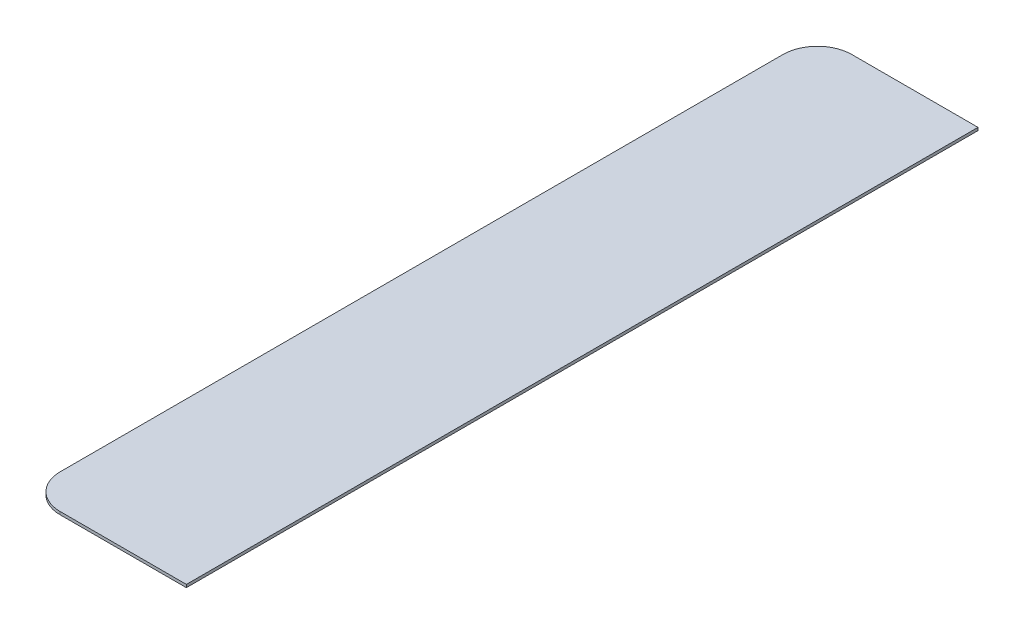
ISO-10303-21;
HEADER;
FILE_DESCRIPTION(('STEP AP214'),'2;1');
FILE_NAME('part.step','',(''),(''),'','','');
FILE_SCHEMA(('AUTOMOTIVE_DESIGN { 1 0 10303 214 1 1 1 1 }'));
ENDSEC;
DATA;
#1=APPLICATION_CONTEXT('core data for automotive mechanical design processes');
#2=APPLICATION_PROTOCOL_DEFINITION('international standard','automotive_design',2000,#1);
#3=PRODUCT_CONTEXT('',#1,'mechanical');
#4=PRODUCT('Part','Part','',(#3));
#5=PRODUCT_RELATED_PRODUCT_CATEGORY('part','',(#4));
#6=PRODUCT_DEFINITION_FORMATION('','',#4);
#7=PRODUCT_DEFINITION_CONTEXT('part definition',#1,'design');
#8=PRODUCT_DEFINITION('design','',#6,#7);
#9=PRODUCT_DEFINITION_SHAPE('','',#8);
#10=(LENGTH_UNIT() NAMED_UNIT(*) SI_UNIT(.MILLI.,.METRE.));
#11=(NAMED_UNIT(*) PLANE_ANGLE_UNIT() SI_UNIT($,.RADIAN.));
#12=(NAMED_UNIT(*) SI_UNIT($,.STERADIAN.) SOLID_ANGLE_UNIT());
#13=UNCERTAINTY_MEASURE_WITH_UNIT(LENGTH_MEASURE(1.E-05),#10,'distance_accuracy_value','');
#14=(GEOMETRIC_REPRESENTATION_CONTEXT(3) GLOBAL_UNCERTAINTY_ASSIGNED_CONTEXT((#13)) GLOBAL_UNIT_ASSIGNED_CONTEXT((#10,
#11,#12)) REPRESENTATION_CONTEXT('',''));
#15=CARTESIAN_POINT('',(0.,0.,0.));
#16=DIRECTION('',(0.,0.,1.));
#17=DIRECTION('',(1.,0.,0.));
#18=AXIS2_PLACEMENT_3D('',#15,#16,#17);
#19=CARTESIAN_POINT('',(0.,6.35,0.));
#20=DIRECTION('',(-1.,0.,0.));
#21=DIRECTION('',(0.,0.,1.));
#22=AXIS2_PLACEMENT_3D('',#19,#20,#21);
#23=PLANE('',#22);
#24=DIRECTION('',(0.,0.,-1.));
#25=VECTOR('',#24,1.);
#26=CARTESIAN_POINT('',(0.,0.,0.));
#27=LINE('',#26,#25);
#28=CARTESIAN_POINT('',(2.14631598018565E-13,0.,1752.6));
#29=VERTEX_POINT('',#28);
#30=CARTESIAN_POINT('',(0.,0.,0.));
#31=VERTEX_POINT('',#30);
#32=EDGE_CURVE('E121',#29,#31,#27,.T.);
#33=ORIENTED_EDGE('',*,*,#32,.T.);
#34=DIRECTION('',(0.,-1.,0.));
#35=VECTOR('',#34,1.);
#36=CARTESIAN_POINT('',(0.,6.35,0.));
#37=LINE('',#36,#35);
#38=CARTESIAN_POINT('',(0.,6.35,0.));
#39=VERTEX_POINT('',#38);
#40=EDGE_CURVE('E11',#39,#31,#37,.T.);
#41=ORIENTED_EDGE('',*,*,#40,.F.);
#42=DIRECTION('',(0.,0.,-1.));
#43=VECTOR('',#42,1.);
#44=CARTESIAN_POINT('',(0.,6.35,0.));
#45=LINE('',#44,#43);
#46=CARTESIAN_POINT('',(2.14631598018565E-13,6.35,1752.6));
#47=VERTEX_POINT('',#46);
#48=EDGE_CURVE('E131',#47,#39,#45,.T.);
#49=ORIENTED_EDGE('',*,*,#48,.F.);
#50=DIRECTION('',(0.,-1.,0.));
#51=VECTOR('',#50,1.);
#52=CARTESIAN_POINT('',(2.14631598018565E-13,6.35,1752.6));
#53=LINE('',#52,#51);
#54=EDGE_CURVE('E117',#47,#29,#53,.T.);
#55=ORIENTED_EDGE('',*,*,#54,.T.);
#56=EDGE_LOOP('',(#33,#41,#49,#55));
#57=FACE_BOUND('',#56,.T.);
#58=ADVANCED_FACE('F37',(#57),#23,.F.);
#59=CARTESIAN_POINT('',(0.,6.35,0.));
#60=DIRECTION('',(0.,0.,1.));
#61=DIRECTION('',(1.,0.,0.));
#62=AXIS2_PLACEMENT_3D('',#59,#60,#61);
#63=PLANE('',#62);
#64=DIRECTION('',(-1.,0.,0.));
#65=VECTOR('',#64,1.);
#66=CARTESIAN_POINT('',(0.,0.,0.));
#67=LINE('',#66,#65);
#68=CARTESIAN_POINT('',(-279.399999999999,0.,0.));
#69=VERTEX_POINT('',#68);
#70=EDGE_CURVE('E124',#31,#69,#67,.T.);
#71=ORIENTED_EDGE('',*,*,#70,.T.);
#72=DIRECTION('',(0.,-1.,0.));
#73=VECTOR('',#72,1.);
#74=CARTESIAN_POINT('',(-279.399999999999,6.35,0.));
#75=LINE('',#74,#73);
#76=CARTESIAN_POINT('',(-279.399999999999,6.35,0.));
#77=VERTEX_POINT('',#76);
#78=EDGE_CURVE('E45',#77,#69,#75,.T.);
#79=ORIENTED_EDGE('',*,*,#78,.F.);
#80=DIRECTION('',(-1.,0.,0.));
#81=VECTOR('',#80,1.);
#82=CARTESIAN_POINT('',(0.,6.35,0.));
#83=LINE('',#82,#81);
#84=EDGE_CURVE('E90',#39,#77,#83,.T.);
#85=ORIENTED_EDGE('',*,*,#84,.F.);
#86=ORIENTED_EDGE('',*,*,#40,.T.);
#87=EDGE_LOOP('',(#71,#79,#85,#86));
#88=FACE_BOUND('',#87,.T.);
#89=ADVANCED_FACE('F155',(#88),#63,.F.);
#90=CARTESIAN_POINT('',(-279.4,6.35,76.2));
#91=DIRECTION('',(0.,-1.,0.));
#92=DIRECTION('',(0.,0.,-1.));
#93=AXIS2_PLACEMENT_3D('',#90,#91,#92);
#94=CYLINDRICAL_SURFACE('',#93,76.2);
#95=CARTESIAN_POINT('',(-279.4,0.,76.2));
#96=DIRECTION('',(0.,1.,0.));
#97=DIRECTION('',(0.,0.,-1.));
#98=AXIS2_PLACEMENT_3D('',#95,#96,#97);
#99=CIRCLE('',#98,76.2);
#100=CARTESIAN_POINT('',(-355.6,0.,76.2000000000006));
#101=VERTEX_POINT('',#100);
#102=EDGE_CURVE('E126',#69,#101,#99,.T.);
#103=ORIENTED_EDGE('',*,*,#102,.T.);
#104=DIRECTION('',(0.,-1.,0.));
#105=VECTOR('',#104,1.);
#106=CARTESIAN_POINT('',(-355.6,6.35,76.2000000000006));
#107=LINE('',#106,#105);
#108=CARTESIAN_POINT('',(-355.6,6.35,76.2000000000006));
#109=VERTEX_POINT('',#108);
#110=EDGE_CURVE('E112',#109,#101,#107,.T.);
#111=ORIENTED_EDGE('',*,*,#110,.F.);
#112=CARTESIAN_POINT('',(-279.4,6.35,76.2));
#113=DIRECTION('',(0.,1.,0.));
#114=DIRECTION('',(0.,0.,-1.));
#115=AXIS2_PLACEMENT_3D('',#112,#113,#114);
#116=CIRCLE('',#115,76.2);
#117=EDGE_CURVE('E103',#77,#109,#116,.T.);
#118=ORIENTED_EDGE('',*,*,#117,.F.);
#119=ORIENTED_EDGE('',*,*,#78,.T.);
#120=EDGE_LOOP('',(#103,#111,#118,#119));
#121=FACE_BOUND('',#120,.T.);
#122=ADVANCED_FACE('F137',(#121),#94,.T.);
#123=CARTESIAN_POINT('',(-355.6,6.35,76.2000000000006));
#124=DIRECTION('',(1.,0.,0.));
#125=DIRECTION('',(0.,0.,-1.));
#126=AXIS2_PLACEMENT_3D('',#123,#124,#125);
#127=PLANE('',#126);
#128=DIRECTION('',(0.,0.,1.));
#129=VECTOR('',#128,1.);
#130=CARTESIAN_POINT('',(-355.6,0.,76.2000000000006));
#131=LINE('',#130,#129);
#132=CARTESIAN_POINT('',(-355.6,0.,1676.4));
#133=VERTEX_POINT('',#132);
#134=EDGE_CURVE('E111',#101,#133,#131,.T.);
#135=ORIENTED_EDGE('',*,*,#134,.T.);
#136=DIRECTION('',(0.,-1.,0.));
#137=VECTOR('',#136,1.);
#138=CARTESIAN_POINT('',(-355.6,6.35,1676.4));
#139=LINE('',#138,#137);
#140=CARTESIAN_POINT('',(-355.6,6.35,1676.4));
#141=VERTEX_POINT('',#140);
#142=EDGE_CURVE('E108',#141,#133,#139,.T.);
#143=ORIENTED_EDGE('',*,*,#142,.F.);
#144=DIRECTION('',(0.,0.,1.));
#145=VECTOR('',#144,1.);
#146=CARTESIAN_POINT('',(-355.6,6.35,76.2000000000006));
#147=LINE('',#146,#145);
#148=EDGE_CURVE('E97',#109,#141,#147,.T.);
#149=ORIENTED_EDGE('',*,*,#148,.F.);
#150=ORIENTED_EDGE('',*,*,#110,.T.);
#151=EDGE_LOOP('',(#135,#143,#149,#150));
#152=FACE_BOUND('',#151,.T.);
#153=ADVANCED_FACE('F109',(#152),#127,.F.);
#154=CARTESIAN_POINT('',(-279.4,6.35,1676.4));
#155=DIRECTION('',(0.,-1.,0.));
#156=DIRECTION('',(0.,0.,-1.));
#157=AXIS2_PLACEMENT_3D('',#154,#155,#156);
#158=CYLINDRICAL_SURFACE('',#157,76.2);
#159=CARTESIAN_POINT('',(-279.4,0.,1676.4));
#160=DIRECTION('',(0.,1.,0.));
#161=DIRECTION('',(0.,0.,1.));
#162=AXIS2_PLACEMENT_3D('',#159,#160,#161);
#163=CIRCLE('',#162,76.2);
#164=CARTESIAN_POINT('',(-279.4,0.,1752.6));
#165=VERTEX_POINT('',#164);
#166=EDGE_CURVE('E76',#133,#165,#163,.T.);
#167=ORIENTED_EDGE('',*,*,#166,.T.);
#168=DIRECTION('',(0.,-1.,0.));
#169=VECTOR('',#168,1.);
#170=CARTESIAN_POINT('',(-279.4,6.35,1752.6));
#171=LINE('',#170,#169);
#172=CARTESIAN_POINT('',(-279.4,6.35,1752.6));
#173=VERTEX_POINT('',#172);
#174=EDGE_CURVE('E113',#173,#165,#171,.T.);
#175=ORIENTED_EDGE('',*,*,#174,.F.);
#176=CARTESIAN_POINT('',(-279.4,6.35,1676.4));
#177=DIRECTION('',(0.,1.,0.));
#178=DIRECTION('',(0.,0.,1.));
#179=AXIS2_PLACEMENT_3D('',#176,#177,#178);
#180=CIRCLE('',#179,76.2);
#181=EDGE_CURVE('E101',#141,#173,#180,.T.);
#182=ORIENTED_EDGE('',*,*,#181,.F.);
#183=ORIENTED_EDGE('',*,*,#142,.T.);
#184=EDGE_LOOP('',(#167,#175,#182,#183));
#185=FACE_BOUND('',#184,.T.);
#186=ADVANCED_FACE('F115',(#185),#158,.T.);
#187=CARTESIAN_POINT('',(2.14631598018565E-13,6.35,1752.6));
#188=DIRECTION('',(0.,0.,-1.));
#189=DIRECTION('',(-1.,0.,0.));
#190=AXIS2_PLACEMENT_3D('',#187,#188,#189);
#191=PLANE('',#190);
#192=DIRECTION('',(1.,0.,0.));
#193=VECTOR('',#192,1.);
#194=CARTESIAN_POINT('',(2.14631598018565E-13,0.,1752.6));
#195=LINE('',#194,#193);
#196=EDGE_CURVE('E82',#165,#29,#195,.T.);
#197=ORIENTED_EDGE('',*,*,#196,.T.);
#198=ORIENTED_EDGE('',*,*,#54,.F.);
#199=DIRECTION('',(1.,0.,0.));
#200=VECTOR('',#199,1.);
#201=CARTESIAN_POINT('',(2.14631598018565E-13,6.35,1752.6));
#202=LINE('',#201,#200);
#203=EDGE_CURVE('E53',#173,#47,#202,.T.);
#204=ORIENTED_EDGE('',*,*,#203,.F.);
#205=ORIENTED_EDGE('',*,*,#174,.T.);
#206=EDGE_LOOP('',(#197,#198,#204,#205));
#207=FACE_BOUND('',#206,.T.);
#208=ADVANCED_FACE('F144',(#207),#191,.F.);
#209=CARTESIAN_POINT('',(-279.4,6.35,1676.4));
#210=DIRECTION('',(0.,1.,0.));
#211=DIRECTION('',(0.,0.,1.));
#212=AXIS2_PLACEMENT_3D('',#209,#210,#211);
#213=PLANE('',#212);
#214=ORIENTED_EDGE('',*,*,#48,.T.);
#215=ORIENTED_EDGE('',*,*,#84,.T.);
#216=ORIENTED_EDGE('',*,*,#117,.T.);
#217=ORIENTED_EDGE('',*,*,#148,.T.);
#218=ORIENTED_EDGE('',*,*,#181,.T.);
#219=ORIENTED_EDGE('',*,*,#203,.T.);
#220=EDGE_LOOP('',(#214,#215,#216,#217,#218,#219));
#221=FACE_BOUND('',#220,.T.);
#222=ADVANCED_FACE('F99',(#221),#213,.T.);
#223=CARTESIAN_POINT('',(-279.4,0.,1676.4));
#224=DIRECTION('',(0.,1.,0.));
#225=DIRECTION('',(0.,0.,1.));
#226=AXIS2_PLACEMENT_3D('',#223,#224,#225);
#227=PLANE('',#226);
#228=ORIENTED_EDGE('',*,*,#32,.F.);
#229=ORIENTED_EDGE('',*,*,#196,.F.);
#230=ORIENTED_EDGE('',*,*,#166,.F.);
#231=ORIENTED_EDGE('',*,*,#134,.F.);
#232=ORIENTED_EDGE('',*,*,#102,.F.);
#233=ORIENTED_EDGE('',*,*,#70,.F.);
#234=EDGE_LOOP('',(#228,#229,#230,#231,#232,#233));
#235=FACE_BOUND('',#234,.T.);
#236=ADVANCED_FACE('F140',(#235),#227,.F.);
#237=CLOSED_SHELL('',(#58,#89,#122,#153,#186,#208,#222,#236));
#238=MANIFOLD_SOLID_BREP('B2',#237);
#239=ADVANCED_BREP_SHAPE_REPRESENTATION('',(#18,#238),#14);
#240=SHAPE_DEFINITION_REPRESENTATION(#9,#239);
ENDSEC;
END-ISO-10303-21;
